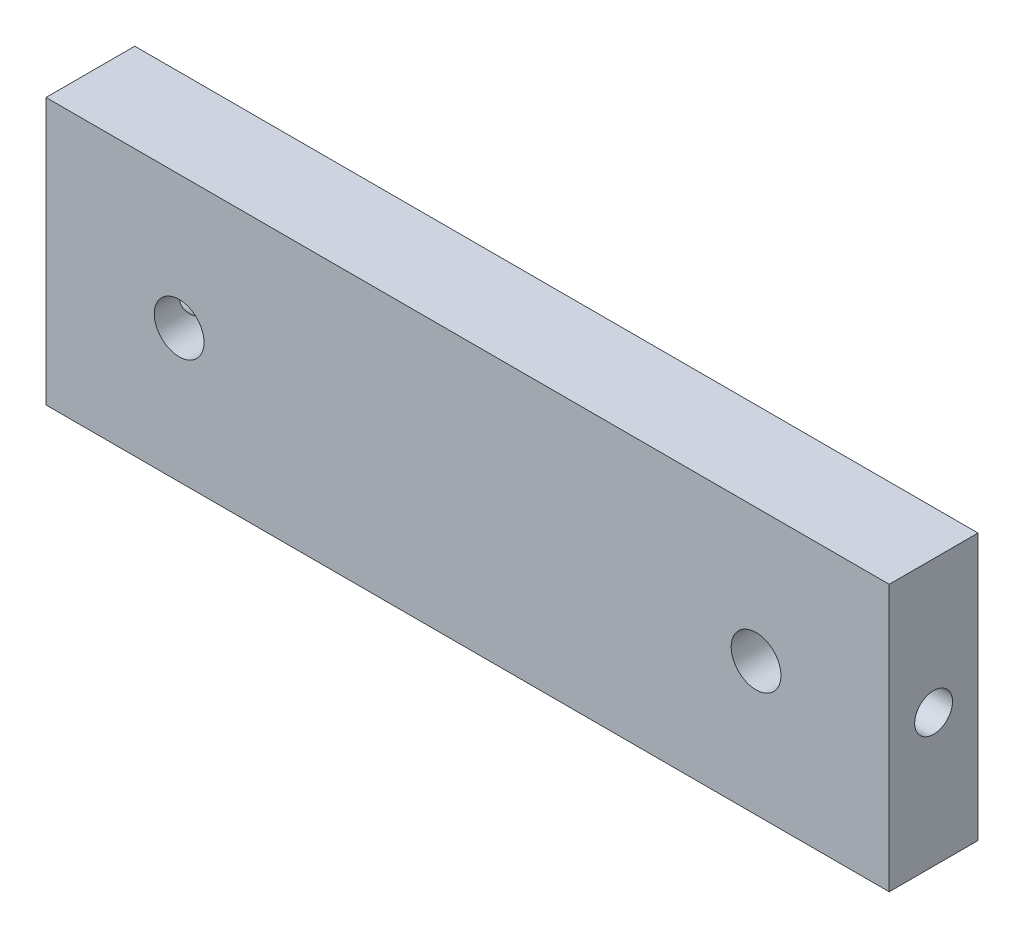
ISO-10303-21;
HEADER;
FILE_DESCRIPTION(('STEP AP214'),'2;1');
FILE_NAME('part.step','',(''),(''),'','','');
FILE_SCHEMA(('AUTOMOTIVE_DESIGN { 1 0 10303 214 1 1 1 1 }'));
ENDSEC;
DATA;
#1=APPLICATION_CONTEXT('core data for automotive mechanical design processes');
#2=APPLICATION_PROTOCOL_DEFINITION('international standard','automotive_design',2000,#1);
#3=PRODUCT_CONTEXT('',#1,'mechanical');
#4=PRODUCT('Part','Part','',(#3));
#5=PRODUCT_RELATED_PRODUCT_CATEGORY('part','',(#4));
#6=PRODUCT_DEFINITION_FORMATION('','',#4);
#7=PRODUCT_DEFINITION_CONTEXT('part definition',#1,'design');
#8=PRODUCT_DEFINITION('design','',#6,#7);
#9=PRODUCT_DEFINITION_SHAPE('','',#8);
#10=(LENGTH_UNIT() NAMED_UNIT(*) SI_UNIT(.MILLI.,.METRE.));
#11=(NAMED_UNIT(*) PLANE_ANGLE_UNIT() SI_UNIT($,.RADIAN.));
#12=(NAMED_UNIT(*) SI_UNIT($,.STERADIAN.) SOLID_ANGLE_UNIT());
#13=UNCERTAINTY_MEASURE_WITH_UNIT(LENGTH_MEASURE(1.E-05),#10,'distance_accuracy_value','');
#14=(GEOMETRIC_REPRESENTATION_CONTEXT(3) GLOBAL_UNCERTAINTY_ASSIGNED_CONTEXT((#13)) GLOBAL_UNIT_ASSIGNED_CONTEXT((#10,
#11,#12)) REPRESENTATION_CONTEXT('',''));
#15=CARTESIAN_POINT('',(0.,0.,0.));
#16=DIRECTION('',(0.,0.,1.));
#17=DIRECTION('',(1.,0.,0.));
#18=AXIS2_PLACEMENT_3D('',#15,#16,#17);
#19=CARTESIAN_POINT('',(0.,0.,6.35));
#20=DIRECTION('',(1.,0.,0.));
#21=DIRECTION('',(0.,0.,-1.));
#22=AXIS2_PLACEMENT_3D('',#19,#20,#21);
#23=PLANE('',#22);
#24=CARTESIAN_POINT('',(0.,9.525,3.175));
#25=DIRECTION('',(-1.,0.,0.));
#26=DIRECTION('',(0.,0.,1.));
#27=AXIS2_PLACEMENT_3D('',#24,#25,#26);
#28=CIRCLE('',#27,1.35255);
#29=CARTESIAN_POINT('',(0.,9.525,4.52755));
#30=VERTEX_POINT('',#29);
#31=EDGE_CURVE('E133',#30,#30,#28,.T.);
#32=ORIENTED_EDGE('',*,*,#31,.F.);
#33=EDGE_LOOP('',(#32));
#34=FACE_BOUND('',#33,.T.);
#35=DIRECTION('',(0.,-1.,0.));
#36=VECTOR('',#35,1.);
#37=CARTESIAN_POINT('',(0.,0.,0.));
#38=LINE('',#37,#36);
#39=CARTESIAN_POINT('',(0.,19.05,0.));
#40=VERTEX_POINT('',#39);
#41=CARTESIAN_POINT('',(0.,0.,0.));
#42=VERTEX_POINT('',#41);
#43=EDGE_CURVE('E118',#40,#42,#38,.T.);
#44=ORIENTED_EDGE('',*,*,#43,.T.);
#45=DIRECTION('',(0.,0.,-1.));
#46=VECTOR('',#45,1.);
#47=CARTESIAN_POINT('',(0.,0.,6.35));
#48=LINE('',#47,#46);
#49=CARTESIAN_POINT('',(0.,0.,6.35));
#50=VERTEX_POINT('',#49);
#51=EDGE_CURVE('E13',#50,#42,#48,.T.);
#52=ORIENTED_EDGE('',*,*,#51,.F.);
#53=DIRECTION('',(0.,-1.,0.));
#54=VECTOR('',#53,1.);
#55=CARTESIAN_POINT('',(0.,0.,6.35));
#56=LINE('',#55,#54);
#57=CARTESIAN_POINT('',(0.,19.05,6.35));
#58=VERTEX_POINT('',#57);
#59=EDGE_CURVE('E105',#58,#50,#56,.T.);
#60=ORIENTED_EDGE('',*,*,#59,.F.);
#61=DIRECTION('',(0.,0.,-1.));
#62=VECTOR('',#61,1.);
#63=CARTESIAN_POINT('',(0.,19.05,6.35));
#64=LINE('',#63,#62);
#65=EDGE_CURVE('E114',#58,#40,#64,.T.);
#66=ORIENTED_EDGE('',*,*,#65,.T.);
#67=EDGE_LOOP('',(#44,#52,#60,#66));
#68=FACE_BOUND('',#67,.T.);
#69=ADVANCED_FACE('F48',(#34,#68),#23,.F.);
#70=CARTESIAN_POINT('',(0.,0.,6.35));
#71=DIRECTION('',(0.,1.,0.));
#72=DIRECTION('',(0.,0.,1.));
#73=AXIS2_PLACEMENT_3D('',#70,#71,#72);
#74=PLANE('',#73);
#75=DIRECTION('',(1.,0.,0.));
#76=VECTOR('',#75,1.);
#77=CARTESIAN_POINT('',(0.,0.,0.));
#78=LINE('',#77,#76);
#79=CARTESIAN_POINT('',(60.3123,0.,0.));
#80=VERTEX_POINT('',#79);
#81=EDGE_CURVE('E109',#42,#80,#78,.T.);
#82=ORIENTED_EDGE('',*,*,#81,.T.);
#83=DIRECTION('',(0.,0.,-1.));
#84=VECTOR('',#83,1.);
#85=CARTESIAN_POINT('',(60.3123,0.,6.35));
#86=LINE('',#85,#84);
#87=CARTESIAN_POINT('',(60.3123,0.,6.35));
#88=VERTEX_POINT('',#87);
#89=EDGE_CURVE('E61',#88,#80,#86,.T.);
#90=ORIENTED_EDGE('',*,*,#89,.F.);
#91=DIRECTION('',(1.,0.,0.));
#92=VECTOR('',#91,1.);
#93=CARTESIAN_POINT('',(0.,0.,6.35));
#94=LINE('',#93,#92);
#95=EDGE_CURVE('E100',#50,#88,#94,.T.);
#96=ORIENTED_EDGE('',*,*,#95,.F.);
#97=ORIENTED_EDGE('',*,*,#51,.T.);
#98=EDGE_LOOP('',(#82,#90,#96,#97));
#99=FACE_BOUND('',#98,.T.);
#100=ADVANCED_FACE('F108',(#99),#74,.F.);
#101=CARTESIAN_POINT('',(60.3123,0.,6.35));
#102=DIRECTION('',(-1.,0.,0.));
#103=DIRECTION('',(0.,0.,1.));
#104=AXIS2_PLACEMENT_3D('',#101,#102,#103);
#105=PLANE('',#104);
#106=CARTESIAN_POINT('',(60.3123,9.525,3.175));
#107=DIRECTION('',(1.,0.,0.));
#108=DIRECTION('',(0.,0.,-1.));
#109=AXIS2_PLACEMENT_3D('',#106,#107,#108);
#110=CIRCLE('',#109,1.35254999999999);
#111=CARTESIAN_POINT('',(60.3123,9.525,1.82245000000001));
#112=VERTEX_POINT('',#111);
#113=EDGE_CURVE('E183',#112,#112,#110,.T.);
#114=ORIENTED_EDGE('',*,*,#113,.F.);
#115=EDGE_LOOP('',(#114));
#116=FACE_BOUND('',#115,.T.);
#117=DIRECTION('',(0.,1.,0.));
#118=VECTOR('',#117,1.);
#119=CARTESIAN_POINT('',(60.3123,0.,0.));
#120=LINE('',#119,#118);
#121=CARTESIAN_POINT('',(60.3123,19.05,0.));
#122=VERTEX_POINT('',#121);
#123=EDGE_CURVE('E87',#80,#122,#120,.T.);
#124=ORIENTED_EDGE('',*,*,#123,.T.);
#125=DIRECTION('',(0.,0.,-1.));
#126=VECTOR('',#125,1.);
#127=CARTESIAN_POINT('',(60.3123,19.05,6.35));
#128=LINE('',#127,#126);
#129=CARTESIAN_POINT('',(60.3123,19.05,6.35));
#130=VERTEX_POINT('',#129);
#131=EDGE_CURVE('E110',#130,#122,#128,.T.);
#132=ORIENTED_EDGE('',*,*,#131,.F.);
#133=DIRECTION('',(0.,1.,0.));
#134=VECTOR('',#133,1.);
#135=CARTESIAN_POINT('',(60.3123,0.,6.35));
#136=LINE('',#135,#134);
#137=EDGE_CURVE('E103',#88,#130,#136,.T.);
#138=ORIENTED_EDGE('',*,*,#137,.F.);
#139=ORIENTED_EDGE('',*,*,#89,.T.);
#140=EDGE_LOOP('',(#124,#132,#138,#139));
#141=FACE_BOUND('',#140,.T.);
#142=ADVANCED_FACE('F112',(#116,#141),#105,.F.);
#143=CARTESIAN_POINT('',(0.,19.05,6.35));
#144=DIRECTION('',(0.,-1.,0.));
#145=DIRECTION('',(0.,0.,-1.));
#146=AXIS2_PLACEMENT_3D('',#143,#144,#145);
#147=PLANE('',#146);
#148=DIRECTION('',(-1.,0.,0.));
#149=VECTOR('',#148,1.);
#150=CARTESIAN_POINT('',(0.,19.05,0.));
#151=LINE('',#150,#149);
#152=EDGE_CURVE('E93',#122,#40,#151,.T.);
#153=ORIENTED_EDGE('',*,*,#152,.T.);
#154=ORIENTED_EDGE('',*,*,#65,.F.);
#155=DIRECTION('',(-1.,0.,0.));
#156=VECTOR('',#155,1.);
#157=CARTESIAN_POINT('',(0.,19.05,6.35));
#158=LINE('',#157,#156);
#159=EDGE_CURVE('E70',#130,#58,#158,.T.);
#160=ORIENTED_EDGE('',*,*,#159,.F.);
#161=ORIENTED_EDGE('',*,*,#131,.T.);
#162=EDGE_LOOP('',(#153,#154,#160,#161));
#163=FACE_BOUND('',#162,.T.);
#164=ADVANCED_FACE('F170',(#163),#147,.F.);
#165=CARTESIAN_POINT('',(0.,19.05,6.35));
#166=DIRECTION('',(0.,0.,-1.));
#167=DIRECTION('',(-1.,0.,0.));
#168=AXIS2_PLACEMENT_3D('',#165,#166,#167);
#169=PLANE('',#168);
#170=CARTESIAN_POINT('',(50.7873,9.525,6.35));
#171=DIRECTION('',(0.,0.,1.));
#172=DIRECTION('',(1.,0.,0.));
#173=AXIS2_PLACEMENT_3D('',#170,#171,#172);
#174=CIRCLE('',#173,1.778);
#175=CARTESIAN_POINT('',(52.5653,9.525,6.35));
#176=VERTEX_POINT('',#175);
#177=EDGE_CURVE('E132',#176,#176,#174,.T.);
#178=ORIENTED_EDGE('',*,*,#177,.F.);
#179=EDGE_LOOP('',(#178));
#180=FACE_BOUND('',#179,.T.);
#181=CARTESIAN_POINT('',(9.525,9.525,6.35));
#182=DIRECTION('',(0.,0.,1.));
#183=DIRECTION('',(1.,0.,0.));
#184=AXIS2_PLACEMENT_3D('',#181,#182,#183);
#185=CIRCLE('',#184,1.778);
#186=CARTESIAN_POINT('',(11.303,9.525,6.35));
#187=VERTEX_POINT('',#186);
#188=EDGE_CURVE('E190',#187,#187,#185,.T.);
#189=ORIENTED_EDGE('',*,*,#188,.F.);
#190=EDGE_LOOP('',(#189));
#191=FACE_BOUND('',#190,.T.);
#192=ORIENTED_EDGE('',*,*,#59,.T.);
#193=ORIENTED_EDGE('',*,*,#95,.T.);
#194=ORIENTED_EDGE('',*,*,#137,.T.);
#195=ORIENTED_EDGE('',*,*,#159,.T.);
#196=EDGE_LOOP('',(#192,#193,#194,#195));
#197=FACE_BOUND('',#196,.T.);
#198=ADVANCED_FACE('F101',(#180,#191,#197),#169,.F.);
#199=CARTESIAN_POINT('',(0.,19.05,0.));
#200=DIRECTION('',(0.,0.,-1.));
#201=DIRECTION('',(-1.,0.,0.));
#202=AXIS2_PLACEMENT_3D('',#199,#200,#201);
#203=PLANE('',#202);
#204=CARTESIAN_POINT('',(50.7873,9.525,0.));
#205=DIRECTION('',(0.,0.,1.));
#206=DIRECTION('',(1.,0.,0.));
#207=AXIS2_PLACEMENT_3D('',#204,#205,#206);
#208=CIRCLE('',#207,1.778);
#209=CARTESIAN_POINT('',(52.5653,9.525,0.));
#210=VERTEX_POINT('',#209);
#211=EDGE_CURVE('E188',#210,#210,#208,.T.);
#212=ORIENTED_EDGE('',*,*,#211,.T.);
#213=EDGE_LOOP('',(#212));
#214=FACE_BOUND('',#213,.T.);
#215=CARTESIAN_POINT('',(9.525,9.525,0.));
#216=DIRECTION('',(0.,0.,1.));
#217=DIRECTION('',(1.,0.,0.));
#218=AXIS2_PLACEMENT_3D('',#215,#216,#217);
#219=CIRCLE('',#218,1.778);
#220=CARTESIAN_POINT('',(11.303,9.525,0.));
#221=VERTEX_POINT('',#220);
#222=EDGE_CURVE('E121',#221,#221,#219,.T.);
#223=ORIENTED_EDGE('',*,*,#222,.T.);
#224=EDGE_LOOP('',(#223));
#225=FACE_BOUND('',#224,.T.);
#226=ORIENTED_EDGE('',*,*,#43,.F.);
#227=ORIENTED_EDGE('',*,*,#152,.F.);
#228=ORIENTED_EDGE('',*,*,#123,.F.);
#229=ORIENTED_EDGE('',*,*,#81,.F.);
#230=EDGE_LOOP('',(#226,#227,#228,#229));
#231=FACE_BOUND('',#230,.T.);
#232=ADVANCED_FACE('F150',(#214,#225,#231),#203,.T.);
#233=CARTESIAN_POINT('',(9.525,9.525,0.));
#234=DIRECTION('',(0.,0.,1.));
#235=DIRECTION('',(1.,0.,0.));
#236=AXIS2_PLACEMENT_3D('',#233,#234,#235);
#237=CYLINDRICAL_SURFACE('',#236,1.778);
#238=CARTESIAN_POINT('',(7.747,9.525,4.52755));
#239=CARTESIAN_POINT('',(7.747005120892,9.59081623274751,4.5275446833929));
#240=CARTESIAN_POINT('',(7.75069180704347,9.65671589831385,4.52270816369258));
#241=CARTESIAN_POINT('',(7.76510620060708,9.78641557434088,4.50367255000671));
#242=CARTESIAN_POINT('',(7.77584802079086,9.85021110659428,4.48945468974687));
#243=CARTESIAN_POINT('',(7.80334387417839,9.97349892797805,4.45263692123175));
#244=CARTESIAN_POINT('',(7.82006206623453,10.0330143827258,4.43008695525382));
#245=CARTESIAN_POINT('',(7.85826484963585,10.1470106667715,4.37767816693626));
#246=CARTESIAN_POINT('',(7.87974870729648,10.201492269215,4.34782046956467));
#247=CARTESIAN_POINT('',(7.92831130362231,10.3096678425812,4.27871424106221));
#248=CARTESIAN_POINT('',(7.95572493229286,10.3628147456522,4.23884968849072));
#249=CARTESIAN_POINT('',(8.01291159967027,10.4621036174162,4.15252995103554));
#250=CARTESIAN_POINT('',(8.04268811527327,10.5082349608205,4.10606497142815));
#251=CARTESIAN_POINT('',(8.10900496126607,10.6021213130315,3.99684339777918));
#252=CARTESIAN_POINT('',(8.14565877823805,10.6482022124998,3.93271120837047));
#253=CARTESIAN_POINT('',(8.21572800092272,10.7291342448959,3.79608212220251));
#254=CARTESIAN_POINT('',(8.24914745104023,10.7639995325928,3.72359592695998));
#255=CARTESIAN_POINT('',(8.29695217354343,10.8110370464738,3.5972706947784));
#256=CARTESIAN_POINT('',(8.31390560203957,10.8268808765087,3.5457841477997));
#257=CARTESIAN_POINT('',(8.34202034458572,10.8524812927084,3.43984203144835));
#258=CARTESIAN_POINT('',(8.35319514399215,10.8622520622036,3.38539370535339));
#259=CARTESIAN_POINT('',(8.36799685777329,10.8750866771625,3.27408429271187));
#260=CARTESIAN_POINT('',(8.37154835864876,10.8780835268726,3.21720472618543));
#261=CARTESIAN_POINT('',(8.37011435505913,10.8768591661166,3.10362272078091));
#262=CARTESIAN_POINT('',(8.36512701100789,10.8726364002761,3.04692032270819));
#263=CARTESIAN_POINT('',(8.34868918991928,10.8582935993621,2.94221900090233));
#264=CARTESIAN_POINT('',(8.33806182563304,10.8489201360001,2.89397716646368));
#265=CARTESIAN_POINT('',(8.31234332562322,10.825404649053,2.7999089422327));
#266=CARTESIAN_POINT('',(8.29724761087562,10.8112577316923,2.75408508734661));
#267=CARTESIAN_POINT('',(8.25331963684761,10.7682054281516,2.63658420578281));
#268=CARTESIAN_POINT('',(8.22189336946962,10.7356577319655,2.56721356883488));
#269=CARTESIAN_POINT('',(8.15574124734123,10.6603174029444,2.43595060278226));
#270=CARTESIAN_POINT('',(8.12100728555834,10.6174991863835,2.37407753871658));
#271=CARTESIAN_POINT('',(8.05076058939236,10.5207821722936,2.25643085375406));
#272=CARTESIAN_POINT('',(8.01525468557508,10.4665966385413,2.20088774327815));
#273=CARTESIAN_POINT('',(7.94766167597324,10.3483539700435,2.09910849538209));
#274=CARTESIAN_POINT('',(7.91556832847098,10.2843154010676,2.05285522367229));
#275=CARTESIAN_POINT('',(7.86322171304458,10.1601460899398,1.97911172570514));
#276=CARTESIAN_POINT('',(7.8418778217344,10.1016068192729,1.94972503450837));
#277=CARTESIAN_POINT('',(7.80484318512855,9.97932872981405,1.89932756227599));
#278=CARTESIAN_POINT('',(7.78914908485993,9.91559302445471,1.87831180959688));
#279=CARTESIAN_POINT('',(7.76467961885104,9.78396250760968,1.84573241102885));
#280=CARTESIAN_POINT('',(7.755950831483,9.71604291483113,1.83423238001389));
#281=CARTESIAN_POINT('',(7.74648130533183,9.57869830881292,1.82176172685191));
#282=CARTESIAN_POINT('',(7.7457363096101,9.50927411761124,1.82078549343956));
#283=CARTESIAN_POINT('',(7.75193378618309,9.37904017289857,1.82894075169575));
#284=CARTESIAN_POINT('',(7.75804640859121,9.31811693992983,1.83698109119072));
#285=CARTESIAN_POINT('',(7.77614343520465,9.19876492480107,1.86097232845607));
#286=CARTESIAN_POINT('',(7.78812895137045,9.14033661730306,1.87692472428435));
#287=CARTESIAN_POINT('',(7.8174631416235,9.02581239210051,1.91644156098346));
#288=CARTESIAN_POINT('',(7.83494074597089,8.96981390233613,1.94018968347289));
#289=CARTESIAN_POINT('',(7.87399333905008,8.86264162072927,1.99420450053682));
#290=CARTESIAN_POINT('',(7.89556895002123,8.81146856334621,2.02447218513217));
#291=CARTESIAN_POINT('',(7.94540316390411,8.70642406420291,2.09610936557713));
#292=CARTESIAN_POINT('',(7.97417748397433,8.65348629076092,2.138485466556));
#293=CARTESIAN_POINT('',(8.0337895553744,8.55500033792529,2.23000133817605));
#294=CARTESIAN_POINT('',(8.06463134908374,8.50946726895183,2.27915457028009));
#295=CARTESIAN_POINT('',(8.13246661639644,8.41775406874433,2.39407462859235));
#296=CARTESIAN_POINT('',(8.16945775757638,8.37326299709857,2.46119853784452));
#297=CARTESIAN_POINT('',(8.23893597028817,8.29617984848311,2.60407824368));
#298=CARTESIAN_POINT('',(8.27143324056259,8.2635605445613,2.67981375948899));
#299=CARTESIAN_POINT('',(8.31512117799614,8.22191953572198,2.80888171085918));
#300=CARTESIAN_POINT('',(8.3297044855007,8.20864515291234,2.85967706166241));
#301=CARTESIAN_POINT('',(8.35283602039945,8.18800384716894,2.96373530998742));
#302=CARTESIAN_POINT('',(8.36139868779459,8.18062278379309,3.01699197471875));
#303=CARTESIAN_POINT('',(8.37110439257758,8.17227801069038,3.12510914680572));
#304=CARTESIAN_POINT('',(8.37219332350749,8.17136109717897,3.17997846771401));
#305=CARTESIAN_POINT('',(8.36658701652079,8.17615862059877,3.28904399621304));
#306=CARTESIAN_POINT('',(8.35988424721523,8.18187947352661,3.3432395012873));
#307=CARTESIAN_POINT('',(8.338341404683,8.20085679968915,3.45769713837867));
#308=CARTESIAN_POINT('',(8.32238337384578,8.21516069686164,3.51756561105243));
#309=CARTESIAN_POINT('',(8.28452072646679,8.25096267970898,3.63315137620064));
#310=CARTESIAN_POINT('',(8.26260068416956,8.27247946162342,3.68885741570176));
#311=CARTESIAN_POINT('',(8.20614841220181,8.33161511601366,3.81684725921215));
#312=CARTESIAN_POINT('',(8.17004511646936,8.37223886551396,3.88704241226056));
#313=CARTESIAN_POINT('',(8.09644023946366,8.46480332493383,4.01871584239478));
#314=CARTESIAN_POINT('',(8.05893708186944,8.51675713254151,4.08018389392397));
#315=CARTESIAN_POINT('',(7.98571443561246,8.63244888984702,4.19453677235028));
#316=CARTESIAN_POINT('',(7.95003060458601,8.69635353993682,4.24727735767779));
#317=CARTESIAN_POINT('',(7.88464941998115,8.83481348688169,4.34118474362665));
#318=CARTESIAN_POINT('',(7.85493842879659,8.90934384114051,4.38237799681311));
#319=CARTESIAN_POINT('',(7.8118819338652,9.04532145466365,4.44115812347842));
#320=CARTESIAN_POINT('',(7.79628329950264,9.10460392776768,4.46212493621694));
#321=CARTESIAN_POINT('',(7.77111338349718,9.22664002123375,4.49573929680195));
#322=CARTESIAN_POINT('',(7.7615271932244,9.28938463263237,4.50840742580359));
#323=CARTESIAN_POINT('',(7.7525759520528,9.38140466305832,4.52021326272973));
#324=CARTESIAN_POINT('',(7.75049009113595,9.4100066589261,4.52295934530937));
#325=CARTESIAN_POINT('',(7.74770083716958,9.46740041401884,4.52662908475432));
#326=CARTESIAN_POINT('',(7.74699775858402,9.49619221491479,4.52755232708054));
#327=CARTESIAN_POINT('',(7.747,9.525,4.52755));
#328=B_SPLINE_CURVE_WITH_KNOTS('',3,(#238,#239,#240,#241,#242,#243,#244,#245,#246,#247,#248,
#249,#250,#251,#252,#253,#254,#255,#256,#257,#258,#259,#260,#261,#262,#263,#264,#265,#266,#267,
#268,#269,#270,#271,#272,#273,#274,#275,#276,#277,#278,#279,#280,#281,#282,#283,#284,#285,#286,
#287,#288,#289,#290,#291,#292,#293,#294,#295,#296,#297,#298,#299,#300,#301,#302,#303,#304,#305,
#306,#307,#308,#309,#310,#311,#312,#313,#314,#315,#316,#317,#318,#319,#320,#321,#322,#323,#324,
#325,#326,#327),.UNSPECIFIED.,.T.,.F.,(4,2,2,2,2,2,2,2,2,2,2,2,2,2,2,2,2,2,2,2,2,2,2,2,2,2,2,2,
2,2,2,2,2,2,2,2,2,2,2,2,2,2,2,2,4),(0.,0.197324853760894,0.39504563437113,0.591600018001237,
0.78812416263308,1.00297190457147,1.21814186734088,1.4782627572921,1.73805405937842,
1.90692296780565,2.07539599465778,2.24552810398773,2.41569687074086,2.56598590406469,
2.71642948519279,2.96353615933085,3.21126488478738,3.46621839153258,3.72069725115884,
3.92654991199555,4.13228013046612,4.33937483963228,4.54635912089801,4.73076101359689,
4.91519783403363,5.10433636955439,5.2935036467709,5.51369238067729,5.73432495268798,
5.99904821875222,6.26316047928862,6.42605919862902,6.5885658739052,6.75224779423849,
6.91608805972398,7.10580396949173,7.29601548671726,7.56097992269594,7.82625230004865,
8.09554602768511,8.36421772123898,8.55780337349536,8.75090708745218,8.83725660112775,
8.92362574961613),.UNSPECIFIED.);
#329=CARTESIAN_POINT('',(7.747,9.525,4.52755));
#330=VERTEX_POINT('',#329);
#331=EDGE_CURVE('E126',#330,#330,#328,.T.);
#332=ORIENTED_EDGE('',*,*,#331,.T.);
#333=EDGE_LOOP('',(#332));
#334=FACE_BOUND('',#333,.T.);
#335=ORIENTED_EDGE('',*,*,#222,.F.);
#336=EDGE_LOOP('',(#335));
#337=FACE_BOUND('',#336,.T.);
#338=ORIENTED_EDGE('',*,*,#188,.T.);
#339=EDGE_LOOP('',(#338));
#340=FACE_BOUND('',#339,.T.);
#341=ADVANCED_FACE('F134',(#334,#337,#340),#237,.F.);
#342=CARTESIAN_POINT('',(50.7873,9.525,0.));
#343=DIRECTION('',(0.,0.,1.));
#344=DIRECTION('',(1.,0.,0.));
#345=AXIS2_PLACEMENT_3D('',#342,#343,#344);
#346=CYLINDRICAL_SURFACE('',#345,1.778);
#347=CARTESIAN_POINT('',(52.5653,9.525,1.82245000000001));
#348=CARTESIAN_POINT('',(52.565294879108,9.59081623274751,1.82245531660711));
#349=CARTESIAN_POINT('',(52.5616081929565,9.65671589831385,1.82729183630743));
#350=CARTESIAN_POINT('',(52.5471937993929,9.78641557434088,1.8463274499933));
#351=CARTESIAN_POINT('',(52.5364519792091,9.85021110659428,1.86054531025314));
#352=CARTESIAN_POINT('',(52.5089561258216,9.97349892797804,1.89736307876826));
#353=CARTESIAN_POINT('',(52.4922379337655,10.0330143827258,1.91991304474618));
#354=CARTESIAN_POINT('',(52.4540351503641,10.1470106667714,1.97232183306374));
#355=CARTESIAN_POINT('',(52.4325512927035,10.201492269215,2.00217953043534));
#356=CARTESIAN_POINT('',(52.3839886963777,10.3096678425812,2.0712857589378));
#357=CARTESIAN_POINT('',(52.3565750677071,10.3628147456522,2.11115031150929));
#358=CARTESIAN_POINT('',(52.2993884003297,10.4621036174162,2.19747004896447));
#359=CARTESIAN_POINT('',(52.2696118847267,10.5082349608205,2.24393502857186));
#360=CARTESIAN_POINT('',(52.2032950387339,10.6021213130315,2.35315660222083));
#361=CARTESIAN_POINT('',(52.1666412217619,10.6482022124998,2.41728879162954));
#362=CARTESIAN_POINT('',(52.0965719990773,10.7291342448959,2.55391787779749));
#363=CARTESIAN_POINT('',(52.0631525489598,10.7639995325928,2.62640407304002));
#364=CARTESIAN_POINT('',(52.0153478264566,10.8110370464738,2.7527293052216));
#365=CARTESIAN_POINT('',(51.9983943979604,10.8268808765087,2.8042158522003));
#366=CARTESIAN_POINT('',(51.9702796554143,10.8524812927084,2.91015796855166));
#367=CARTESIAN_POINT('',(51.9591048560079,10.8622520622036,2.96460629464662));
#368=CARTESIAN_POINT('',(51.9443031422267,10.8750866771625,3.07591570728813));
#369=CARTESIAN_POINT('',(51.9407516413512,10.8780835268726,3.13279527381457));
#370=CARTESIAN_POINT('',(51.9421856449409,10.8768591661166,3.24637727921909));
#371=CARTESIAN_POINT('',(51.9471729889921,10.8726364002761,3.30307967729181));
#372=CARTESIAN_POINT('',(51.9636108100807,10.8582935993621,3.40778099909767));
#373=CARTESIAN_POINT('',(51.974238174367,10.8489201360001,3.45602283353632));
#374=CARTESIAN_POINT('',(51.9999566743768,10.825404649053,3.5500910577673));
#375=CARTESIAN_POINT('',(52.0150523891244,10.8112577316922,3.59591491265338));
#376=CARTESIAN_POINT('',(52.0589803631524,10.7682054281516,3.71341579421719));
#377=CARTESIAN_POINT('',(52.0904066305304,10.7356577319654,3.78278643116512));
#378=CARTESIAN_POINT('',(52.1565587526588,10.6603174029444,3.91404939721774));
#379=CARTESIAN_POINT('',(52.1912927144417,10.6174991863835,3.97592246128341));
#380=CARTESIAN_POINT('',(52.2615394106076,10.5207821722936,4.09356914624594));
#381=CARTESIAN_POINT('',(52.2970453144249,10.4665966385413,4.14911225672184));
#382=CARTESIAN_POINT('',(52.3646383240268,10.3483539700435,4.25089150461791));
#383=CARTESIAN_POINT('',(52.396731671529,10.2843154010675,4.2971447763277));
#384=CARTESIAN_POINT('',(52.4490782869554,10.1601460899398,4.37088827429486));
#385=CARTESIAN_POINT('',(52.4704221782656,10.1016068192728,4.40027496549162));
#386=CARTESIAN_POINT('',(52.5074568148714,9.97932872981404,4.450672437724));
#387=CARTESIAN_POINT('',(52.5231509151401,9.9155930244547,4.47168819040311));
#388=CARTESIAN_POINT('',(52.547620381149,9.78396250760968,4.50426758897114));
#389=CARTESIAN_POINT('',(52.556349168517,9.71604291483113,4.5157676199861));
#390=CARTESIAN_POINT('',(52.5658186946682,9.57869830881292,4.52823827314808));
#391=CARTESIAN_POINT('',(52.5665636903899,9.50927411761124,4.52921450656043));
#392=CARTESIAN_POINT('',(52.5603662138169,9.37904017289857,4.52105924830424));
#393=CARTESIAN_POINT('',(52.5542535914088,9.31811693992983,4.51301890880927));
#394=CARTESIAN_POINT('',(52.5361565647953,9.19876492480108,4.48902767154392));
#395=CARTESIAN_POINT('',(52.5241710486295,9.14033661730306,4.47307527571564));
#396=CARTESIAN_POINT('',(52.4948368583765,9.02581239210051,4.43355843901653));
#397=CARTESIAN_POINT('',(52.4773592540291,8.96981390233614,4.4098103165271));
#398=CARTESIAN_POINT('',(52.4383066609499,8.86264162072928,4.35579549946317));
#399=CARTESIAN_POINT('',(52.4167310499788,8.81146856334622,4.32552781486782));
#400=CARTESIAN_POINT('',(52.3668968360959,8.70642406420291,4.25389063442286));
#401=CARTESIAN_POINT('',(52.3381225160257,8.65348629076093,4.21151453344399));
#402=CARTESIAN_POINT('',(52.2785104446256,8.55500033792529,4.11999866182394));
#403=CARTESIAN_POINT('',(52.2476686509163,8.50946726895183,4.0708454297199));
#404=CARTESIAN_POINT('',(52.1798333836036,8.41775406874434,3.95592537140764));
#405=CARTESIAN_POINT('',(52.1428422424236,8.37326299709857,3.88880146215547));
#406=CARTESIAN_POINT('',(52.0733640297118,8.29617984848312,3.74592175631999));
#407=CARTESIAN_POINT('',(52.0408667594374,8.26356054456131,3.67018624051101));
#408=CARTESIAN_POINT('',(51.9971788220039,8.22191953572199,3.54111828914082));
#409=CARTESIAN_POINT('',(51.9825955144993,8.20864515291235,3.49032293833758));
#410=CARTESIAN_POINT('',(51.9594639796006,8.18800384716895,3.38626469001257));
#411=CARTESIAN_POINT('',(51.9509013122054,8.1806227837931,3.33300802528124));
#412=CARTESIAN_POINT('',(51.9411956074224,8.17227801069039,3.22489085319427));
#413=CARTESIAN_POINT('',(51.9401066764925,8.17136109717898,3.17002153228598));
#414=CARTESIAN_POINT('',(51.9457129834792,8.17615862059878,3.06095600378696));
#415=CARTESIAN_POINT('',(51.9524157527848,8.18187947352662,3.00676049871269));
#416=CARTESIAN_POINT('',(51.973958595317,8.20085679968915,2.89230286162133));
#417=CARTESIAN_POINT('',(51.9899166261542,8.21516069686164,2.83243438894756));
#418=CARTESIAN_POINT('',(52.0277792735332,8.25096267970899,2.71684862379936));
#419=CARTESIAN_POINT('',(52.0496993158304,8.27247946162343,2.66114258429823));
#420=CARTESIAN_POINT('',(52.1061515877982,8.33161511601367,2.53315274078784));
#421=CARTESIAN_POINT('',(52.1422548835306,8.37223886551397,2.46295758773944));
#422=CARTESIAN_POINT('',(52.2158597605363,8.46480332493384,2.33128415760521));
#423=CARTESIAN_POINT('',(52.2533629181306,8.51675713254153,2.26981610607602));
#424=CARTESIAN_POINT('',(52.3265855643875,8.63244888984704,2.15546322764972));
#425=CARTESIAN_POINT('',(52.362269395414,8.69635353993684,2.10272264232221));
#426=CARTESIAN_POINT('',(52.4276505800188,8.8348134868817,2.00881525637336));
#427=CARTESIAN_POINT('',(52.4573615712034,8.90934384114053,1.9676220031869));
#428=CARTESIAN_POINT('',(52.5004180661348,9.04532145466367,1.90884187652158));
#429=CARTESIAN_POINT('',(52.5160167004974,9.1046039277677,1.88787506378306));
#430=CARTESIAN_POINT('',(52.5411866165028,9.22664002123377,1.85426070319806));
#431=CARTESIAN_POINT('',(52.5507728067756,9.28938463263239,1.84159257419642));
#432=CARTESIAN_POINT('',(52.5597240479472,9.38140466305833,1.82978673727028));
#433=CARTESIAN_POINT('',(52.561809908864,9.4100066589261,1.82704065469064));
#434=CARTESIAN_POINT('',(52.5645991628304,9.46740041401885,1.82337091524569));
#435=CARTESIAN_POINT('',(52.565302241416,9.49619221491479,1.82244767291947));
#436=CARTESIAN_POINT('',(52.5653,9.525,1.82245000000001));
#437=B_SPLINE_CURVE_WITH_KNOTS('',3,(#347,#348,#349,#350,#351,#352,#353,#354,#355,#356,#357,
#358,#359,#360,#361,#362,#363,#364,#365,#366,#367,#368,#369,#370,#371,#372,#373,#374,#375,#376,
#377,#378,#379,#380,#381,#382,#383,#384,#385,#386,#387,#388,#389,#390,#391,#392,#393,#394,#395,
#396,#397,#398,#399,#400,#401,#402,#403,#404,#405,#406,#407,#408,#409,#410,#411,#412,#413,#414,
#415,#416,#417,#418,#419,#420,#421,#422,#423,#424,#425,#426,#427,#428,#429,#430,#431,#432,#433,
#434,#435,#436),.UNSPECIFIED.,.T.,.F.,(4,2,2,2,2,2,2,2,2,2,2,2,2,2,2,2,2,2,2,2,2,2,2,2,2,2,2,2,
2,2,2,2,2,2,2,2,2,2,2,2,2,2,2,2,4),(0.,0.197324853760894,0.395045634371128,0.591600018001234,
0.788124162633073,1.00297190457146,1.21814186734087,1.47826275729209,1.7380540593784,
1.90692296780564,2.07539599465777,2.24552810398772,2.41569687074084,2.56598590406467,
2.71642948519277,2.96353615933083,3.21126488478736,3.46621839153256,3.72069725115881,
3.92654991199552,4.13228013046609,4.33937483963224,4.54635912089797,4.73076101359686,
4.91519783403359,5.10433636955436,5.29350364677086,5.51369238067725,5.73432495268794,
5.99904821875218,6.26316047928857,6.42605919862897,6.58856587390515,6.75224779423844,
6.91608805972393,7.10580396949169,7.29601548671721,7.56097992269589,7.8262523000486,
8.09554602768505,8.36421772123893,8.55780337349531,8.75090708745212,8.83725660112769,
8.92362574961606),.UNSPECIFIED.);
#438=CARTESIAN_POINT('',(52.5653,9.525,1.82245000000001));
#439=VERTEX_POINT('',#438);
#440=EDGE_CURVE('E51',#439,#439,#437,.T.);
#441=ORIENTED_EDGE('',*,*,#440,.T.);
#442=EDGE_LOOP('',(#441));
#443=FACE_BOUND('',#442,.T.);
#444=ORIENTED_EDGE('',*,*,#211,.F.);
#445=EDGE_LOOP('',(#444));
#446=FACE_BOUND('',#445,.T.);
#447=ORIENTED_EDGE('',*,*,#177,.T.);
#448=EDGE_LOOP('',(#447));
#449=FACE_BOUND('',#448,.T.);
#450=ADVANCED_FACE('F141',(#443,#446,#449),#346,.F.);
#451=CARTESIAN_POINT('',(0.,9.525,3.175));
#452=DIRECTION('',(-1.,0.,0.));
#453=DIRECTION('',(0.,0.,1.));
#454=AXIS2_PLACEMENT_3D('',#451,#452,#453);
#455=CYLINDRICAL_SURFACE('',#454,1.35255);
#456=ORIENTED_EDGE('',*,*,#31,.T.);
#457=EDGE_LOOP('',(#456));
#458=FACE_BOUND('',#457,.T.);
#459=ORIENTED_EDGE('',*,*,#331,.F.);
#460=EDGE_LOOP('',(#459));
#461=FACE_BOUND('',#460,.T.);
#462=ADVANCED_FACE('F137',(#458,#461),#455,.F.);
#463=CARTESIAN_POINT('',(60.3123,9.525,3.175));
#464=DIRECTION('',(1.,0.,0.));
#465=DIRECTION('',(0.,0.,-1.));
#466=AXIS2_PLACEMENT_3D('',#463,#464,#465);
#467=CYLINDRICAL_SURFACE('',#466,1.35254999999999);
#468=ORIENTED_EDGE('',*,*,#113,.T.);
#469=EDGE_LOOP('',(#468));
#470=FACE_BOUND('',#469,.T.);
#471=ORIENTED_EDGE('',*,*,#440,.F.);
#472=EDGE_LOOP('',(#471));
#473=FACE_BOUND('',#472,.T.);
#474=ADVANCED_FACE('F140',(#470,#473),#467,.F.);
#475=CLOSED_SHELL('',(#69,#100,#142,#164,#198,#232,#341,#450,#462,#474));
#476=MANIFOLD_SOLID_BREP('B2',#475);
#477=ADVANCED_BREP_SHAPE_REPRESENTATION('',(#18,#476),#14);
#478=SHAPE_DEFINITION_REPRESENTATION(#9,#477);
ENDSEC;
END-ISO-10303-21;
